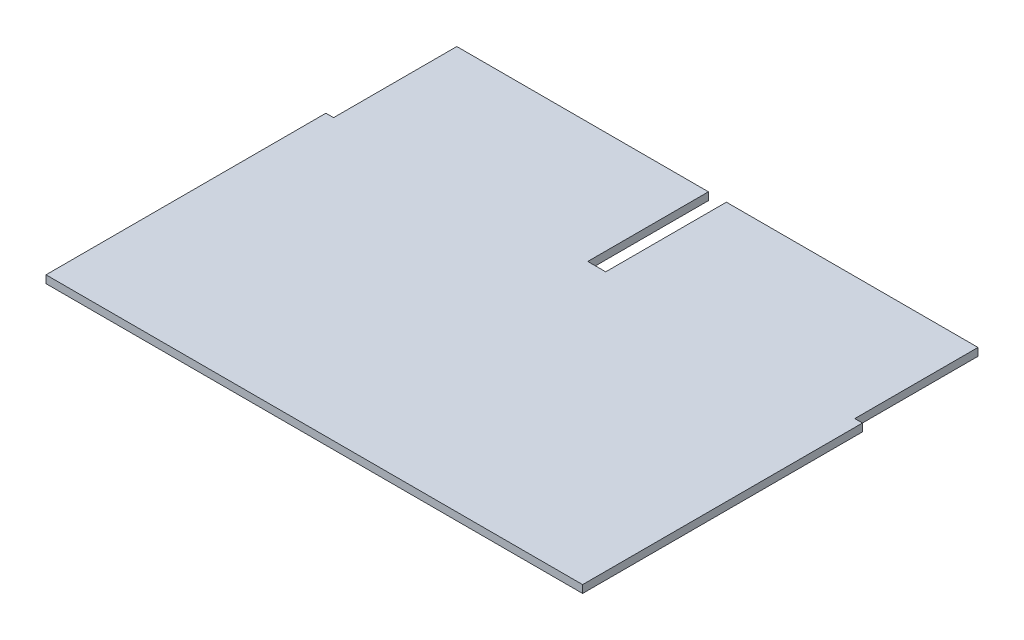
ISO-10303-21;
HEADER;
FILE_DESCRIPTION(('STEP AP214'),'2;1');
FILE_NAME('part.step','',(''),(''),'','','');
FILE_SCHEMA(('AUTOMOTIVE_DESIGN { 1 0 10303 214 1 1 1 1 }'));
ENDSEC;
DATA;
#1=APPLICATION_CONTEXT('core data for automotive mechanical design processes');
#2=APPLICATION_PROTOCOL_DEFINITION('international standard','automotive_design',2000,#1);
#3=PRODUCT_CONTEXT('',#1,'mechanical');
#4=PRODUCT('Part','Part','',(#3));
#5=PRODUCT_RELATED_PRODUCT_CATEGORY('part','',(#4));
#6=PRODUCT_DEFINITION_FORMATION('','',#4);
#7=PRODUCT_DEFINITION_CONTEXT('part definition',#1,'design');
#8=PRODUCT_DEFINITION('design','',#6,#7);
#9=PRODUCT_DEFINITION_SHAPE('','',#8);
#10=(LENGTH_UNIT() NAMED_UNIT(*) SI_UNIT(.MILLI.,.METRE.));
#11=(NAMED_UNIT(*) PLANE_ANGLE_UNIT() SI_UNIT($,.RADIAN.));
#12=(NAMED_UNIT(*) SI_UNIT($,.STERADIAN.) SOLID_ANGLE_UNIT());
#13=UNCERTAINTY_MEASURE_WITH_UNIT(LENGTH_MEASURE(1.E-05),#10,'distance_accuracy_value','');
#14=(GEOMETRIC_REPRESENTATION_CONTEXT(3) GLOBAL_UNCERTAINTY_ASSIGNED_CONTEXT((#13)) GLOBAL_UNIT_ASSIGNED_CONTEXT((#10,
#11,#12)) REPRESENTATION_CONTEXT('',''));
#15=CARTESIAN_POINT('',(0.,0.,0.));
#16=DIRECTION('',(0.,0.,1.));
#17=DIRECTION('',(1.,0.,0.));
#18=AXIS2_PLACEMENT_3D('',#15,#16,#17);
#19=CARTESIAN_POINT('',(0.,0.3,0.));
#20=DIRECTION('',(0.,0.,-1.));
#21=DIRECTION('',(-1.,0.,0.));
#22=AXIS2_PLACEMENT_3D('',#19,#20,#21);
#23=PLANE('',#22);
#24=DIRECTION('',(1.,0.,0.));
#25=VECTOR('',#24,1.);
#26=CARTESIAN_POINT('',(0.,0.,0.));
#27=LINE('',#26,#25);
#28=CARTESIAN_POINT('',(-10.45,0.,0.));
#29=VERTEX_POINT('',#28);
#30=CARTESIAN_POINT('',(10.45,0.,0.));
#31=VERTEX_POINT('',#30);
#32=EDGE_CURVE('E153',#29,#31,#27,.T.);
#33=ORIENTED_EDGE('',*,*,#32,.T.);
#34=DIRECTION('',(0.,-1.,0.));
#35=VECTOR('',#34,1.);
#36=CARTESIAN_POINT('',(10.45,0.3,0.));
#37=LINE('',#36,#35);
#38=CARTESIAN_POINT('',(10.45,0.3,0.));
#39=VERTEX_POINT('',#38);
#40=EDGE_CURVE('E11',#39,#31,#37,.T.);
#41=ORIENTED_EDGE('',*,*,#40,.F.);
#42=DIRECTION('',(1.,0.,0.));
#43=VECTOR('',#42,1.);
#44=CARTESIAN_POINT('',(0.,0.3,0.));
#45=LINE('',#44,#43);
#46=CARTESIAN_POINT('',(-10.45,0.3,0.));
#47=VERTEX_POINT('',#46);
#48=EDGE_CURVE('E185',#47,#39,#45,.T.);
#49=ORIENTED_EDGE('',*,*,#48,.F.);
#50=DIRECTION('',(0.,-1.,0.));
#51=VECTOR('',#50,1.);
#52=CARTESIAN_POINT('',(-10.45,0.3,0.));
#53=LINE('',#52,#51);
#54=EDGE_CURVE('E48',#47,#29,#53,.T.);
#55=ORIENTED_EDGE('',*,*,#54,.T.);
#56=EDGE_LOOP('',(#33,#41,#49,#55));
#57=FACE_BOUND('',#56,.T.);
#58=ADVANCED_FACE('F32',(#57),#23,.F.);
#59=CARTESIAN_POINT('',(10.45,0.3,0.));
#60=DIRECTION('',(-1.,0.,0.));
#61=DIRECTION('',(0.,0.,1.));
#62=AXIS2_PLACEMENT_3D('',#59,#60,#61);
#63=PLANE('',#62);
#64=DIRECTION('',(0.,0.,-1.));
#65=VECTOR('',#64,1.);
#66=CARTESIAN_POINT('',(10.45,0.,0.));
#67=LINE('',#66,#65);
#68=CARTESIAN_POINT('',(10.45,0.,-10.9));
#69=VERTEX_POINT('',#68);
#70=EDGE_CURVE('E155',#31,#69,#67,.T.);
#71=ORIENTED_EDGE('',*,*,#70,.T.);
#72=DIRECTION('',(0.,-1.,0.));
#73=VECTOR('',#72,1.);
#74=CARTESIAN_POINT('',(10.45,0.3,-10.9));
#75=LINE('',#74,#73);
#76=CARTESIAN_POINT('',(10.45,0.3,-10.9));
#77=VERTEX_POINT('',#76);
#78=EDGE_CURVE('E40',#77,#69,#75,.T.);
#79=ORIENTED_EDGE('',*,*,#78,.F.);
#80=DIRECTION('',(0.,0.,-1.));
#81=VECTOR('',#80,1.);
#82=CARTESIAN_POINT('',(10.45,0.3,0.));
#83=LINE('',#82,#81);
#84=EDGE_CURVE('E98',#39,#77,#83,.T.);
#85=ORIENTED_EDGE('',*,*,#84,.F.);
#86=ORIENTED_EDGE('',*,*,#40,.T.);
#87=EDGE_LOOP('',(#71,#79,#85,#86));
#88=FACE_BOUND('',#87,.T.);
#89=ADVANCED_FACE('F206',(#88),#63,.F.);
#90=CARTESIAN_POINT('',(0.,0.3,-10.9));
#91=DIRECTION('',(0.,0.,-1.));
#92=DIRECTION('',(-1.,0.,0.));
#93=AXIS2_PLACEMENT_3D('',#90,#91,#92);
#94=PLANE('',#93);
#95=DIRECTION('',(1.,0.,0.));
#96=VECTOR('',#95,1.);
#97=CARTESIAN_POINT('',(0.,0.,-10.9));
#98=LINE('',#97,#96);
#99=CARTESIAN_POINT('',(10.15,0.,-10.9));
#100=VERTEX_POINT('',#99);
#101=EDGE_CURVE('E158',#100,#69,#98,.T.);
#102=ORIENTED_EDGE('',*,*,#101,.F.);
#103=DIRECTION('',(0.,-1.,0.));
#104=VECTOR('',#103,1.);
#105=CARTESIAN_POINT('',(10.15,0.3,-10.9));
#106=LINE('',#105,#104);
#107=CARTESIAN_POINT('',(10.15,0.3,-10.9));
#108=VERTEX_POINT('',#107);
#109=EDGE_CURVE('E199',#108,#100,#106,.T.);
#110=ORIENTED_EDGE('',*,*,#109,.F.);
#111=DIRECTION('',(1.,0.,0.));
#112=VECTOR('',#111,1.);
#113=CARTESIAN_POINT('',(0.,0.3,-10.9));
#114=LINE('',#113,#112);
#115=EDGE_CURVE('E205',#108,#77,#114,.T.);
#116=ORIENTED_EDGE('',*,*,#115,.T.);
#117=ORIENTED_EDGE('',*,*,#78,.T.);
#118=EDGE_LOOP('',(#102,#110,#116,#117));
#119=FACE_BOUND('',#118,.T.);
#120=ADVANCED_FACE('F203',(#119),#94,.T.);
#121=CARTESIAN_POINT('',(10.15,0.3,0.));
#122=DIRECTION('',(1.,0.,0.));
#123=DIRECTION('',(0.,0.,-1.));
#124=AXIS2_PLACEMENT_3D('',#121,#122,#123);
#125=PLANE('',#124);
#126=DIRECTION('',(0.,0.,1.));
#127=VECTOR('',#126,1.);
#128=CARTESIAN_POINT('',(10.15,0.,0.));
#129=LINE('',#128,#127);
#130=CARTESIAN_POINT('',(10.15,0.,-15.7));
#131=VERTEX_POINT('',#130);
#132=EDGE_CURVE('E161',#131,#100,#129,.T.);
#133=ORIENTED_EDGE('',*,*,#132,.F.);
#134=DIRECTION('',(0.,-1.,0.));
#135=VECTOR('',#134,1.);
#136=CARTESIAN_POINT('',(10.15,0.3,-15.7));
#137=LINE('',#136,#135);
#138=CARTESIAN_POINT('',(10.15,0.3,-15.7));
#139=VERTEX_POINT('',#138);
#140=EDGE_CURVE('E197',#139,#131,#137,.T.);
#141=ORIENTED_EDGE('',*,*,#140,.F.);
#142=DIRECTION('',(0.,0.,1.));
#143=VECTOR('',#142,1.);
#144=CARTESIAN_POINT('',(10.15,0.3,0.));
#145=LINE('',#144,#143);
#146=EDGE_CURVE('E217',#139,#108,#145,.T.);
#147=ORIENTED_EDGE('',*,*,#146,.T.);
#148=ORIENTED_EDGE('',*,*,#109,.T.);
#149=EDGE_LOOP('',(#133,#141,#147,#148));
#150=FACE_BOUND('',#149,.T.);
#151=ADVANCED_FACE('F214',(#150),#125,.T.);
#152=CARTESIAN_POINT('',(0.,0.3,-15.7));
#153=DIRECTION('',(0.,0.,-1.));
#154=DIRECTION('',(-1.,0.,0.));
#155=AXIS2_PLACEMENT_3D('',#152,#153,#154);
#156=PLANE('',#155);
#157=DIRECTION('',(1.,0.,0.));
#158=VECTOR('',#157,1.);
#159=CARTESIAN_POINT('',(0.,0.,-15.7));
#160=LINE('',#159,#158);
#161=CARTESIAN_POINT('',(0.35,0.,-15.7));
#162=VERTEX_POINT('',#161);
#163=EDGE_CURVE('E164',#162,#131,#160,.T.);
#164=ORIENTED_EDGE('',*,*,#163,.F.);
#165=DIRECTION('',(0.,-1.,0.));
#166=VECTOR('',#165,1.);
#167=CARTESIAN_POINT('',(0.35,0.3,-15.7));
#168=LINE('',#167,#166);
#169=CARTESIAN_POINT('',(0.35,0.3,-15.7));
#170=VERTEX_POINT('',#169);
#171=EDGE_CURVE('E195',#170,#162,#168,.T.);
#172=ORIENTED_EDGE('',*,*,#171,.F.);
#173=DIRECTION('',(1.,0.,0.));
#174=VECTOR('',#173,1.);
#175=CARTESIAN_POINT('',(0.,0.3,-15.7));
#176=LINE('',#175,#174);
#177=EDGE_CURVE('E221',#170,#139,#176,.T.);
#178=ORIENTED_EDGE('',*,*,#177,.T.);
#179=ORIENTED_EDGE('',*,*,#140,.T.);
#180=EDGE_LOOP('',(#164,#172,#178,#179));
#181=FACE_BOUND('',#180,.T.);
#182=ADVANCED_FACE('F259',(#181),#156,.T.);
#183=CARTESIAN_POINT('',(0.35,0.3,0.));
#184=DIRECTION('',(1.,0.,0.));
#185=DIRECTION('',(0.,0.,-1.));
#186=AXIS2_PLACEMENT_3D('',#183,#184,#185);
#187=PLANE('',#186);
#188=DIRECTION('',(0.,0.,1.));
#189=VECTOR('',#188,1.);
#190=CARTESIAN_POINT('',(0.35,0.,0.));
#191=LINE('',#190,#189);
#192=CARTESIAN_POINT('',(0.35,0.,-11.));
#193=VERTEX_POINT('',#192);
#194=EDGE_CURVE('E167',#162,#193,#191,.T.);
#195=ORIENTED_EDGE('',*,*,#194,.T.);
#196=DIRECTION('',(0.,-1.,0.));
#197=VECTOR('',#196,1.);
#198=CARTESIAN_POINT('',(0.35,0.3,-11.));
#199=LINE('',#198,#197);
#200=CARTESIAN_POINT('',(0.35,0.3,-11.));
#201=VERTEX_POINT('',#200);
#202=EDGE_CURVE('E193',#201,#193,#199,.T.);
#203=ORIENTED_EDGE('',*,*,#202,.F.);
#204=DIRECTION('',(0.,0.,1.));
#205=VECTOR('',#204,1.);
#206=CARTESIAN_POINT('',(0.35,0.3,0.));
#207=LINE('',#206,#205);
#208=EDGE_CURVE('E227',#170,#201,#207,.T.);
#209=ORIENTED_EDGE('',*,*,#208,.F.);
#210=ORIENTED_EDGE('',*,*,#171,.T.);
#211=EDGE_LOOP('',(#195,#203,#209,#210));
#212=FACE_BOUND('',#211,.T.);
#213=ADVANCED_FACE('F262',(#212),#187,.F.);
#214=CARTESIAN_POINT('',(0.,0.3,-11.));
#215=DIRECTION('',(0.,0.,-1.));
#216=DIRECTION('',(-1.,0.,0.));
#217=AXIS2_PLACEMENT_3D('',#214,#215,#216);
#218=PLANE('',#217);
#219=DIRECTION('',(1.,0.,0.));
#220=VECTOR('',#219,1.);
#221=CARTESIAN_POINT('',(0.,0.,-11.));
#222=LINE('',#221,#220);
#223=CARTESIAN_POINT('',(-0.35,0.,-11.));
#224=VERTEX_POINT('',#223);
#225=EDGE_CURVE('E170',#224,#193,#222,.T.);
#226=ORIENTED_EDGE('',*,*,#225,.F.);
#227=DIRECTION('',(0.,-1.,0.));
#228=VECTOR('',#227,1.);
#229=CARTESIAN_POINT('',(-0.35,0.3,-11.));
#230=LINE('',#229,#228);
#231=CARTESIAN_POINT('',(-0.35,0.3,-11.));
#232=VERTEX_POINT('',#231);
#233=EDGE_CURVE('E191',#232,#224,#230,.T.);
#234=ORIENTED_EDGE('',*,*,#233,.F.);
#235=DIRECTION('',(1.,0.,0.));
#236=VECTOR('',#235,1.);
#237=CARTESIAN_POINT('',(0.,0.3,-11.));
#238=LINE('',#237,#236);
#239=EDGE_CURVE('E229',#232,#201,#238,.T.);
#240=ORIENTED_EDGE('',*,*,#239,.T.);
#241=ORIENTED_EDGE('',*,*,#202,.T.);
#242=EDGE_LOOP('',(#226,#234,#240,#241));
#243=FACE_BOUND('',#242,.T.);
#244=ADVANCED_FACE('F266',(#243),#218,.T.);
#245=CARTESIAN_POINT('',(-0.35,0.3,0.));
#246=DIRECTION('',(1.,0.,0.));
#247=DIRECTION('',(0.,0.,-1.));
#248=AXIS2_PLACEMENT_3D('',#245,#246,#247);
#249=PLANE('',#248);
#250=DIRECTION('',(0.,0.,1.));
#251=VECTOR('',#250,1.);
#252=CARTESIAN_POINT('',(-0.35,0.,0.));
#253=LINE('',#252,#251);
#254=CARTESIAN_POINT('',(-0.35,0.,-15.7));
#255=VERTEX_POINT('',#254);
#256=EDGE_CURVE('E173',#255,#224,#253,.T.);
#257=ORIENTED_EDGE('',*,*,#256,.F.);
#258=DIRECTION('',(0.,-1.,0.));
#259=VECTOR('',#258,1.);
#260=CARTESIAN_POINT('',(-0.35,0.3,-15.7));
#261=LINE('',#260,#259);
#262=CARTESIAN_POINT('',(-0.35,0.3,-15.7));
#263=VERTEX_POINT('',#262);
#264=EDGE_CURVE('E189',#263,#255,#261,.T.);
#265=ORIENTED_EDGE('',*,*,#264,.F.);
#266=DIRECTION('',(0.,0.,1.));
#267=VECTOR('',#266,1.);
#268=CARTESIAN_POINT('',(-0.35,0.3,0.));
#269=LINE('',#268,#267);
#270=EDGE_CURVE('E232',#263,#232,#269,.T.);
#271=ORIENTED_EDGE('',*,*,#270,.T.);
#272=ORIENTED_EDGE('',*,*,#233,.T.);
#273=EDGE_LOOP('',(#257,#265,#271,#272));
#274=FACE_BOUND('',#273,.T.);
#275=ADVANCED_FACE('F270',(#274),#249,.T.);
#276=CARTESIAN_POINT('',(0.,0.3,-15.7));
#277=DIRECTION('',(0.,0.,-1.));
#278=DIRECTION('',(-1.,0.,0.));
#279=AXIS2_PLACEMENT_3D('',#276,#277,#278);
#280=PLANE('',#279);
#281=DIRECTION('',(1.,0.,0.));
#282=VECTOR('',#281,1.);
#283=CARTESIAN_POINT('',(0.,0.,-15.7));
#284=LINE('',#283,#282);
#285=CARTESIAN_POINT('',(-10.15,0.,-15.7));
#286=VERTEX_POINT('',#285);
#287=EDGE_CURVE('E176',#286,#255,#284,.T.);
#288=ORIENTED_EDGE('',*,*,#287,.F.);
#289=DIRECTION('',(0.,-1.,0.));
#290=VECTOR('',#289,1.);
#291=CARTESIAN_POINT('',(-10.15,0.3,-15.7));
#292=LINE('',#291,#290);
#293=CARTESIAN_POINT('',(-10.15,0.3,-15.7));
#294=VERTEX_POINT('',#293);
#295=EDGE_CURVE('E145',#294,#286,#292,.T.);
#296=ORIENTED_EDGE('',*,*,#295,.F.);
#297=DIRECTION('',(1.,0.,0.));
#298=VECTOR('',#297,1.);
#299=CARTESIAN_POINT('',(0.,0.3,-15.7));
#300=LINE('',#299,#298);
#301=EDGE_CURVE('E135',#294,#263,#300,.T.);
#302=ORIENTED_EDGE('',*,*,#301,.T.);
#303=ORIENTED_EDGE('',*,*,#264,.T.);
#304=EDGE_LOOP('',(#288,#296,#302,#303));
#305=FACE_BOUND('',#304,.T.);
#306=ADVANCED_FACE('F236',(#305),#280,.T.);
#307=CARTESIAN_POINT('',(-10.15,0.3,0.));
#308=DIRECTION('',(1.,0.,0.));
#309=DIRECTION('',(0.,0.,-1.));
#310=AXIS2_PLACEMENT_3D('',#307,#308,#309);
#311=PLANE('',#310);
#312=DIRECTION('',(0.,0.,1.));
#313=VECTOR('',#312,1.);
#314=CARTESIAN_POINT('',(-10.15,0.,0.));
#315=LINE('',#314,#313);
#316=CARTESIAN_POINT('',(-10.15,0.,-10.9));
#317=VERTEX_POINT('',#316);
#318=EDGE_CURVE('E142',#286,#317,#315,.T.);
#319=ORIENTED_EDGE('',*,*,#318,.T.);
#320=DIRECTION('',(0.,-1.,0.));
#321=VECTOR('',#320,1.);
#322=CARTESIAN_POINT('',(-10.15,0.3,-10.9));
#323=LINE('',#322,#321);
#324=CARTESIAN_POINT('',(-10.15,0.3,-10.9));
#325=VERTEX_POINT('',#324);
#326=EDGE_CURVE('E139',#325,#317,#323,.T.);
#327=ORIENTED_EDGE('',*,*,#326,.F.);
#328=DIRECTION('',(0.,0.,1.));
#329=VECTOR('',#328,1.);
#330=CARTESIAN_POINT('',(-10.15,0.3,0.));
#331=LINE('',#330,#329);
#332=EDGE_CURVE('E127',#294,#325,#331,.T.);
#333=ORIENTED_EDGE('',*,*,#332,.F.);
#334=ORIENTED_EDGE('',*,*,#295,.T.);
#335=EDGE_LOOP('',(#319,#327,#333,#334));
#336=FACE_BOUND('',#335,.T.);
#337=ADVANCED_FACE('F140',(#336),#311,.F.);
#338=CARTESIAN_POINT('',(0.,0.3,-10.9));
#339=DIRECTION('',(0.,0.,-1.));
#340=DIRECTION('',(-1.,0.,0.));
#341=AXIS2_PLACEMENT_3D('',#338,#339,#340);
#342=PLANE('',#341);
#343=DIRECTION('',(1.,0.,0.));
#344=VECTOR('',#343,1.);
#345=CARTESIAN_POINT('',(0.,0.,-10.9));
#346=LINE('',#345,#344);
#347=CARTESIAN_POINT('',(-10.45,0.,-10.9));
#348=VERTEX_POINT('',#347);
#349=EDGE_CURVE('E180',#348,#317,#346,.T.);
#350=ORIENTED_EDGE('',*,*,#349,.F.);
#351=DIRECTION('',(0.,-1.,0.));
#352=VECTOR('',#351,1.);
#353=CARTESIAN_POINT('',(-10.45,0.3,-10.9));
#354=LINE('',#353,#352);
#355=CARTESIAN_POINT('',(-10.45,0.3,-10.9));
#356=VERTEX_POINT('',#355);
#357=EDGE_CURVE('E86',#356,#348,#354,.T.);
#358=ORIENTED_EDGE('',*,*,#357,.F.);
#359=DIRECTION('',(1.,0.,0.));
#360=VECTOR('',#359,1.);
#361=CARTESIAN_POINT('',(0.,0.3,-10.9));
#362=LINE('',#361,#360);
#363=EDGE_CURVE('E132',#356,#325,#362,.T.);
#364=ORIENTED_EDGE('',*,*,#363,.T.);
#365=ORIENTED_EDGE('',*,*,#326,.T.);
#366=EDGE_LOOP('',(#350,#358,#364,#365));
#367=FACE_BOUND('',#366,.T.);
#368=ADVANCED_FACE('F147',(#367),#342,.T.);
#369=CARTESIAN_POINT('',(-10.45,0.3,0.));
#370=DIRECTION('',(-1.,0.,0.));
#371=DIRECTION('',(0.,0.,1.));
#372=AXIS2_PLACEMENT_3D('',#369,#370,#371);
#373=PLANE('',#372);
#374=DIRECTION('',(0.,0.,-1.));
#375=VECTOR('',#374,1.);
#376=CARTESIAN_POINT('',(-10.45,0.,0.));
#377=LINE('',#376,#375);
#378=EDGE_CURVE('E182',#29,#348,#377,.T.);
#379=ORIENTED_EDGE('',*,*,#378,.F.);
#380=ORIENTED_EDGE('',*,*,#54,.F.);
#381=DIRECTION('',(0.,0.,-1.));
#382=VECTOR('',#381,1.);
#383=CARTESIAN_POINT('',(-10.45,0.3,0.));
#384=LINE('',#383,#382);
#385=EDGE_CURVE('E148',#47,#356,#384,.T.);
#386=ORIENTED_EDGE('',*,*,#385,.T.);
#387=ORIENTED_EDGE('',*,*,#357,.T.);
#388=EDGE_LOOP('',(#379,#380,#386,#387));
#389=FACE_BOUND('',#388,.T.);
#390=ADVANCED_FACE('F238',(#389),#373,.T.);
#391=CARTESIAN_POINT('',(0.,0.3,0.));
#392=DIRECTION('',(0.,1.,0.));
#393=DIRECTION('',(0.,0.,1.));
#394=AXIS2_PLACEMENT_3D('',#391,#392,#393);
#395=PLANE('',#394);
#396=ORIENTED_EDGE('',*,*,#48,.T.);
#397=ORIENTED_EDGE('',*,*,#84,.T.);
#398=ORIENTED_EDGE('',*,*,#115,.F.);
#399=ORIENTED_EDGE('',*,*,#146,.F.);
#400=ORIENTED_EDGE('',*,*,#177,.F.);
#401=ORIENTED_EDGE('',*,*,#208,.T.);
#402=ORIENTED_EDGE('',*,*,#239,.F.);
#403=ORIENTED_EDGE('',*,*,#270,.F.);
#404=ORIENTED_EDGE('',*,*,#301,.F.);
#405=ORIENTED_EDGE('',*,*,#332,.T.);
#406=ORIENTED_EDGE('',*,*,#363,.F.);
#407=ORIENTED_EDGE('',*,*,#385,.F.);
#408=EDGE_LOOP('',(#396,#397,#398,#399,#400,#401,#402,#403,#404,#405,#406,#407));
#409=FACE_BOUND('',#408,.T.);
#410=ADVANCED_FACE('F129',(#409),#395,.T.);
#411=CARTESIAN_POINT('',(0.,0.,0.));
#412=DIRECTION('',(0.,1.,0.));
#413=DIRECTION('',(0.,0.,1.));
#414=AXIS2_PLACEMENT_3D('',#411,#412,#413);
#415=PLANE('',#414);
#416=ORIENTED_EDGE('',*,*,#32,.F.);
#417=ORIENTED_EDGE('',*,*,#378,.T.);
#418=ORIENTED_EDGE('',*,*,#349,.T.);
#419=ORIENTED_EDGE('',*,*,#318,.F.);
#420=ORIENTED_EDGE('',*,*,#287,.T.);
#421=ORIENTED_EDGE('',*,*,#256,.T.);
#422=ORIENTED_EDGE('',*,*,#225,.T.);
#423=ORIENTED_EDGE('',*,*,#194,.F.);
#424=ORIENTED_EDGE('',*,*,#163,.T.);
#425=ORIENTED_EDGE('',*,*,#132,.T.);
#426=ORIENTED_EDGE('',*,*,#101,.T.);
#427=ORIENTED_EDGE('',*,*,#70,.F.);
#428=EDGE_LOOP('',(#416,#417,#418,#419,#420,#421,#422,#423,#424,#425,#426,#427));
#429=FACE_BOUND('',#428,.T.);
#430=ADVANCED_FACE('F209',(#429),#415,.F.);
#431=CLOSED_SHELL('',(#58,#89,#120,#151,#182,#213,#244,#275,#306,#337,#368,#390,#410,#430));
#432=MANIFOLD_SOLID_BREP('B2',#431);
#433=ADVANCED_BREP_SHAPE_REPRESENTATION('',(#18,#432),#14);
#434=SHAPE_DEFINITION_REPRESENTATION(#9,#433);
ENDSEC;
END-ISO-10303-21;
